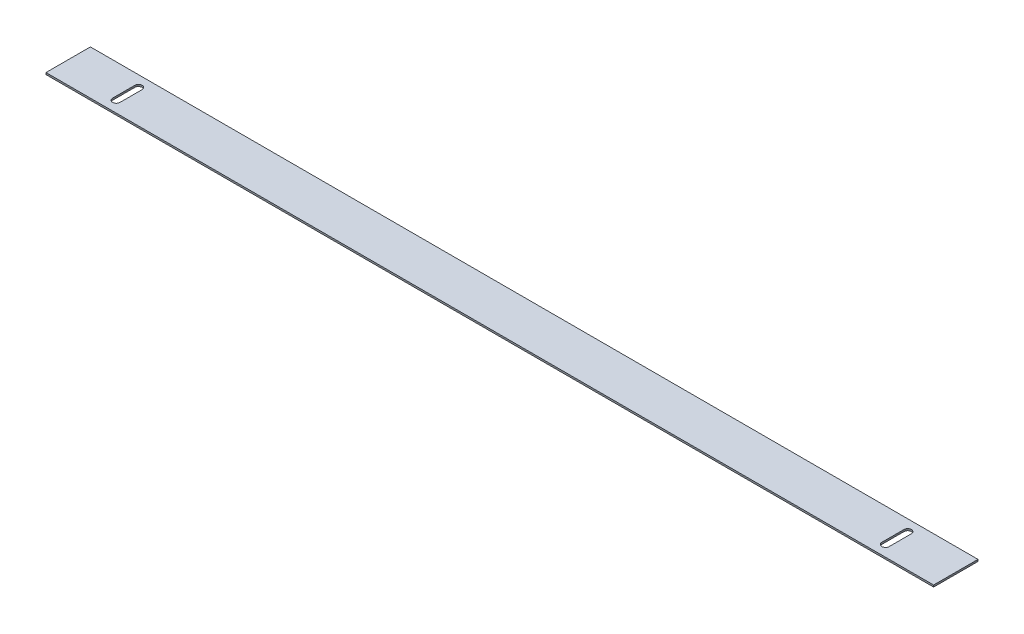
ISO-10303-21;
HEADER;
FILE_DESCRIPTION(('STEP AP214'),'2;1');
FILE_NAME('part.step','',(''),(''),'','','');
FILE_SCHEMA(('AUTOMOTIVE_DESIGN { 1 0 10303 214 1 1 1 1 }'));
ENDSEC;
DATA;
#1=APPLICATION_CONTEXT('core data for automotive mechanical design processes');
#2=APPLICATION_PROTOCOL_DEFINITION('international standard','automotive_design',2000,#1);
#3=PRODUCT_CONTEXT('',#1,'mechanical');
#4=PRODUCT('Part','Part','',(#3));
#5=PRODUCT_RELATED_PRODUCT_CATEGORY('part','',(#4));
#6=PRODUCT_DEFINITION_FORMATION('','',#4);
#7=PRODUCT_DEFINITION_CONTEXT('part definition',#1,'design');
#8=PRODUCT_DEFINITION('design','',#6,#7);
#9=PRODUCT_DEFINITION_SHAPE('','',#8);
#10=(LENGTH_UNIT() NAMED_UNIT(*) SI_UNIT(.MILLI.,.METRE.));
#11=(NAMED_UNIT(*) PLANE_ANGLE_UNIT() SI_UNIT($,.RADIAN.));
#12=(NAMED_UNIT(*) SI_UNIT($,.STERADIAN.) SOLID_ANGLE_UNIT());
#13=UNCERTAINTY_MEASURE_WITH_UNIT(LENGTH_MEASURE(1.E-05),#10,'distance_accuracy_value','');
#14=(GEOMETRIC_REPRESENTATION_CONTEXT(3) GLOBAL_UNCERTAINTY_ASSIGNED_CONTEXT((#13)) GLOBAL_UNIT_ASSIGNED_CONTEXT((#10,
#11,#12)) REPRESENTATION_CONTEXT('',''));
#15=CARTESIAN_POINT('',(0.,0.,0.));
#16=DIRECTION('',(0.,0.,1.));
#17=DIRECTION('',(1.,0.,0.));
#18=AXIS2_PLACEMENT_3D('',#15,#16,#17);
#19=CARTESIAN_POINT('',(0.,0.,0.));
#20=DIRECTION('',(0.,1.,0.));
#21=DIRECTION('',(0.,0.,1.));
#22=AXIS2_PLACEMENT_3D('',#19,#20,#21);
#23=PLANE('',#22);
#24=DIRECTION('',(-1.,0.,0.));
#25=VECTOR('',#24,1.);
#26=CARTESIAN_POINT('',(-381.,0.,-19.05));
#27=LINE('',#26,#25);
#28=CARTESIAN_POINT('',(381.,0.,-19.05));
#29=VERTEX_POINT('',#28);
#30=CARTESIAN_POINT('',(-381.,0.,-19.05));
#31=VERTEX_POINT('',#30);
#32=EDGE_CURVE('E154',#29,#31,#27,.T.);
#33=ORIENTED_EDGE('',*,*,#32,.T.);
#34=DIRECTION('',(0.,0.,1.));
#35=VECTOR('',#34,1.);
#36=CARTESIAN_POINT('',(-381.,0.,-19.05));
#37=LINE('',#36,#35);
#38=CARTESIAN_POINT('',(-381.,0.,19.05));
#39=VERTEX_POINT('',#38);
#40=EDGE_CURVE('E164',#31,#39,#37,.T.);
#41=ORIENTED_EDGE('',*,*,#40,.T.);
#42=DIRECTION('',(1.,0.,0.));
#43=VECTOR('',#42,1.);
#44=CARTESIAN_POINT('',(-381.,0.,19.05));
#45=LINE('',#44,#43);
#46=CARTESIAN_POINT('',(381.,0.,19.05));
#47=VERTEX_POINT('',#46);
#48=EDGE_CURVE('E172',#39,#47,#45,.T.);
#49=ORIENTED_EDGE('',*,*,#48,.T.);
#50=DIRECTION('',(0.,0.,-1.));
#51=VECTOR('',#50,1.);
#52=CARTESIAN_POINT('',(381.,0.,-19.05));
#53=LINE('',#52,#51);
#54=EDGE_CURVE('E177',#47,#29,#53,.T.);
#55=ORIENTED_EDGE('',*,*,#54,.T.);
#56=EDGE_LOOP('',(#33,#41,#49,#55));
#57=FACE_BOUND('',#56,.T.);
#58=CARTESIAN_POINT('',(-330.2,0.,-9.525));
#59=DIRECTION('',(0.,1.,0.));
#60=DIRECTION('',(0.,0.,1.));
#61=AXIS2_PLACEMENT_3D('',#58,#59,#60);
#62=CIRCLE('',#61,3.17499999999998);
#63=CARTESIAN_POINT('',(-327.025,0.,-9.525));
#64=VERTEX_POINT('',#63);
#65=CARTESIAN_POINT('',(-333.375,0.,-9.525));
#66=VERTEX_POINT('',#65);
#67=EDGE_CURVE('E171',#64,#66,#62,.T.);
#68=ORIENTED_EDGE('',*,*,#67,.F.);
#69=DIRECTION('',(0.,0.,-1.));
#70=VECTOR('',#69,1.);
#71=CARTESIAN_POINT('',(-327.025,0.,-9.525));
#72=LINE('',#71,#70);
#73=CARTESIAN_POINT('',(-327.025,0.,9.525));
#74=VERTEX_POINT('',#73);
#75=EDGE_CURVE('E245',#74,#64,#72,.T.);
#76=ORIENTED_EDGE('',*,*,#75,.F.);
#77=CARTESIAN_POINT('',(-330.2,0.,9.525));
#78=DIRECTION('',(0.,1.,0.));
#79=DIRECTION('',(0.,0.,1.));
#80=AXIS2_PLACEMENT_3D('',#77,#78,#79);
#81=CIRCLE('',#80,3.17499999999998);
#82=CARTESIAN_POINT('',(-333.375,0.,9.525));
#83=VERTEX_POINT('',#82);
#84=EDGE_CURVE('E248',#83,#74,#81,.T.);
#85=ORIENTED_EDGE('',*,*,#84,.F.);
#86=DIRECTION('',(0.,0.,1.));
#87=VECTOR('',#86,1.);
#88=CARTESIAN_POINT('',(-333.375,0.,-9.525));
#89=LINE('',#88,#87);
#90=EDGE_CURVE('E252',#66,#83,#89,.T.);
#91=ORIENTED_EDGE('',*,*,#90,.F.);
#92=EDGE_LOOP('',(#68,#76,#85,#91));
#93=FACE_BOUND('',#92,.T.);
#94=CARTESIAN_POINT('',(330.2,0.,-9.525));
#95=DIRECTION('',(0.,1.,0.));
#96=DIRECTION('',(0.,0.,1.));
#97=AXIS2_PLACEMENT_3D('',#94,#95,#96);
#98=CIRCLE('',#97,3.17499999999998);
#99=CARTESIAN_POINT('',(333.375,0.,-9.525));
#100=VERTEX_POINT('',#99);
#101=CARTESIAN_POINT('',(327.025,0.,-9.525));
#102=VERTEX_POINT('',#101);
#103=EDGE_CURVE('E242',#100,#102,#98,.T.);
#104=ORIENTED_EDGE('',*,*,#103,.F.);
#105=DIRECTION('',(0.,0.,-1.));
#106=VECTOR('',#105,1.);
#107=CARTESIAN_POINT('',(333.375,0.,-9.525));
#108=LINE('',#107,#106);
#109=CARTESIAN_POINT('',(333.375,0.,9.525));
#110=VERTEX_POINT('',#109);
#111=EDGE_CURVE('E187',#110,#100,#108,.T.);
#112=ORIENTED_EDGE('',*,*,#111,.F.);
#113=CARTESIAN_POINT('',(330.2,0.,9.525));
#114=DIRECTION('',(0.,1.,0.));
#115=DIRECTION('',(0.,0.,1.));
#116=AXIS2_PLACEMENT_3D('',#113,#114,#115);
#117=CIRCLE('',#116,3.17499999999998);
#118=CARTESIAN_POINT('',(327.025,0.,9.525));
#119=VERTEX_POINT('',#118);
#120=EDGE_CURVE('E236',#119,#110,#117,.T.);
#121=ORIENTED_EDGE('',*,*,#120,.F.);
#122=DIRECTION('',(0.,0.,1.));
#123=VECTOR('',#122,1.);
#124=CARTESIAN_POINT('',(327.025,0.,-9.525));
#125=LINE('',#124,#123);
#126=EDGE_CURVE('E239',#102,#119,#125,.T.);
#127=ORIENTED_EDGE('',*,*,#126,.F.);
#128=EDGE_LOOP('',(#104,#112,#121,#127));
#129=FACE_BOUND('',#128,.T.);
#130=ADVANCED_FACE('F55',(#57,#93,#129),#23,.T.);
#131=CARTESIAN_POINT('',(-381.,0.79375,19.05));
#132=DIRECTION('',(0.,0.,-1.));
#133=DIRECTION('',(-1.,0.,0.));
#134=AXIS2_PLACEMENT_3D('',#131,#132,#133);
#135=PLANE('',#134);
#136=ORIENTED_EDGE('',*,*,#48,.F.);
#137=DIRECTION('',(0.,-1.,0.));
#138=VECTOR('',#137,1.);
#139=CARTESIAN_POINT('',(-381.,0.79375,19.05));
#140=LINE('',#139,#138);
#141=CARTESIAN_POINT('',(-381.,-0.79375,19.05));
#142=VERTEX_POINT('',#141);
#143=EDGE_CURVE('E166',#39,#142,#140,.T.);
#144=ORIENTED_EDGE('',*,*,#143,.T.);
#145=DIRECTION('',(1.,0.,0.));
#146=VECTOR('',#145,1.);
#147=CARTESIAN_POINT('',(-381.,-0.79375,19.05));
#148=LINE('',#147,#146);
#149=CARTESIAN_POINT('',(381.,-0.79375,19.05));
#150=VERTEX_POINT('',#149);
#151=EDGE_CURVE('E269',#142,#150,#148,.T.);
#152=ORIENTED_EDGE('',*,*,#151,.T.);
#153=DIRECTION('',(0.,-1.,0.));
#154=VECTOR('',#153,1.);
#155=CARTESIAN_POINT('',(381.,0.79375,19.05));
#156=LINE('',#155,#154);
#157=EDGE_CURVE('E186',#47,#150,#156,.T.);
#158=ORIENTED_EDGE('',*,*,#157,.F.);
#159=EDGE_LOOP('',(#136,#144,#152,#158));
#160=FACE_BOUND('',#159,.T.);
#161=ADVANCED_FACE('F310',(#160),#135,.F.);
#162=CARTESIAN_POINT('',(-381.,0.79375,-19.05));
#163=DIRECTION('',(1.,0.,0.));
#164=DIRECTION('',(0.,0.,-1.));
#165=AXIS2_PLACEMENT_3D('',#162,#163,#164);
#166=PLANE('',#165);
#167=ORIENTED_EDGE('',*,*,#40,.F.);
#168=DIRECTION('',(0.,-1.,0.));
#169=VECTOR('',#168,1.);
#170=CARTESIAN_POINT('',(-381.,0.79375,-19.05));
#171=LINE('',#170,#169);
#172=CARTESIAN_POINT('',(-381.,-0.79375,-19.05));
#173=VERTEX_POINT('',#172);
#174=EDGE_CURVE('E150',#31,#173,#171,.T.);
#175=ORIENTED_EDGE('',*,*,#174,.T.);
#176=DIRECTION('',(0.,0.,1.));
#177=VECTOR('',#176,1.);
#178=CARTESIAN_POINT('',(-381.,-0.79375,-19.05));
#179=LINE('',#178,#177);
#180=EDGE_CURVE('E196',#173,#142,#179,.T.);
#181=ORIENTED_EDGE('',*,*,#180,.T.);
#182=ORIENTED_EDGE('',*,*,#143,.F.);
#183=EDGE_LOOP('',(#167,#175,#181,#182));
#184=FACE_BOUND('',#183,.T.);
#185=ADVANCED_FACE('F165',(#184),#166,.F.);
#186=CARTESIAN_POINT('',(-333.375,0.79375,-9.525));
#187=DIRECTION('',(1.,0.,0.));
#188=DIRECTION('',(0.,0.,-1.));
#189=AXIS2_PLACEMENT_3D('',#186,#187,#188);
#190=PLANE('',#189);
#191=DIRECTION('',(0.,-1.,0.));
#192=VECTOR('',#191,1.);
#193=CARTESIAN_POINT('',(-333.375,0.79375,-9.525));
#194=LINE('',#193,#192);
#195=CARTESIAN_POINT('',(-333.375,-0.79375,-9.525));
#196=VERTEX_POINT('',#195);
#197=EDGE_CURVE('E192',#66,#196,#194,.T.);
#198=ORIENTED_EDGE('',*,*,#197,.F.);
#199=ORIENTED_EDGE('',*,*,#90,.T.);
#200=DIRECTION('',(0.,-1.,0.));
#201=VECTOR('',#200,1.);
#202=CARTESIAN_POINT('',(-333.375,0.79375,9.525));
#203=LINE('',#202,#201);
#204=CARTESIAN_POINT('',(-333.375,-0.79375,9.525));
#205=VERTEX_POINT('',#204);
#206=EDGE_CURVE('E195',#83,#205,#203,.T.);
#207=ORIENTED_EDGE('',*,*,#206,.T.);
#208=DIRECTION('',(0.,0.,1.));
#209=VECTOR('',#208,1.);
#210=CARTESIAN_POINT('',(-333.375,-0.79375,-9.525));
#211=LINE('',#210,#209);
#212=EDGE_CURVE('E285',#196,#205,#211,.T.);
#213=ORIENTED_EDGE('',*,*,#212,.F.);
#214=EDGE_LOOP('',(#198,#199,#207,#213));
#215=FACE_BOUND('',#214,.T.);
#216=ADVANCED_FACE('F300',(#215),#190,.T.);
#217=CARTESIAN_POINT('',(327.025,0.79375,-9.525));
#218=DIRECTION('',(1.,0.,0.));
#219=DIRECTION('',(0.,0.,-1.));
#220=AXIS2_PLACEMENT_3D('',#217,#218,#219);
#221=PLANE('',#220);
#222=DIRECTION('',(0.,-1.,0.));
#223=VECTOR('',#222,1.);
#224=CARTESIAN_POINT('',(327.025,0.79375,-9.525));
#225=LINE('',#224,#223);
#226=CARTESIAN_POINT('',(327.025,-0.79375,-9.525));
#227=VERTEX_POINT('',#226);
#228=EDGE_CURVE('E73',#102,#227,#225,.T.);
#229=ORIENTED_EDGE('',*,*,#228,.F.);
#230=ORIENTED_EDGE('',*,*,#126,.T.);
#231=DIRECTION('',(0.,-1.,0.));
#232=VECTOR('',#231,1.);
#233=CARTESIAN_POINT('',(327.025,0.79375,9.525));
#234=LINE('',#233,#232);
#235=CARTESIAN_POINT('',(327.025,-0.79375,9.525));
#236=VERTEX_POINT('',#235);
#237=EDGE_CURVE('E80',#119,#236,#234,.T.);
#238=ORIENTED_EDGE('',*,*,#237,.T.);
#239=DIRECTION('',(0.,0.,1.));
#240=VECTOR('',#239,1.);
#241=CARTESIAN_POINT('',(327.025,-0.79375,-9.525));
#242=LINE('',#241,#240);
#243=EDGE_CURVE('E65',#227,#236,#242,.T.);
#244=ORIENTED_EDGE('',*,*,#243,.F.);
#245=EDGE_LOOP('',(#229,#230,#238,#244));
#246=FACE_BOUND('',#245,.T.);
#247=ADVANCED_FACE('F314',(#246),#221,.T.);
#248=CARTESIAN_POINT('',(0.,-0.79375,0.));
#249=DIRECTION('',(0.,1.,0.));
#250=DIRECTION('',(0.,0.,1.));
#251=AXIS2_PLACEMENT_3D('',#248,#249,#250);
#252=PLANE('',#251);
#253=CARTESIAN_POINT('',(-330.2,-0.79375,-9.525));
#254=DIRECTION('',(0.,1.,0.));
#255=DIRECTION('',(0.,0.,1.));
#256=AXIS2_PLACEMENT_3D('',#253,#254,#255);
#257=CIRCLE('',#256,3.17499999999998);
#258=CARTESIAN_POINT('',(-327.025,-0.79375,-9.525));
#259=VERTEX_POINT('',#258);
#260=EDGE_CURVE('E208',#259,#196,#257,.T.);
#261=ORIENTED_EDGE('',*,*,#260,.T.);
#262=ORIENTED_EDGE('',*,*,#212,.T.);
#263=CARTESIAN_POINT('',(-330.2,-0.79375,9.525));
#264=DIRECTION('',(0.,1.,0.));
#265=DIRECTION('',(0.,0.,1.));
#266=AXIS2_PLACEMENT_3D('',#263,#264,#265);
#267=CIRCLE('',#266,3.17499999999998);
#268=CARTESIAN_POINT('',(-327.025,-0.79375,9.525));
#269=VERTEX_POINT('',#268);
#270=EDGE_CURVE('E282',#205,#269,#267,.T.);
#271=ORIENTED_EDGE('',*,*,#270,.T.);
#272=DIRECTION('',(0.,0.,-1.));
#273=VECTOR('',#272,1.);
#274=CARTESIAN_POINT('',(-327.025,-0.79375,-9.525));
#275=LINE('',#274,#273);
#276=EDGE_CURVE('E205',#269,#259,#275,.T.);
#277=ORIENTED_EDGE('',*,*,#276,.T.);
#278=EDGE_LOOP('',(#261,#262,#271,#277));
#279=FACE_BOUND('',#278,.T.);
#280=ORIENTED_EDGE('',*,*,#180,.F.);
#281=DIRECTION('',(-1.,0.,0.));
#282=VECTOR('',#281,1.);
#283=CARTESIAN_POINT('',(-381.,-0.79375,-19.05));
#284=LINE('',#283,#282);
#285=CARTESIAN_POINT('',(381.,-0.79375,-19.05));
#286=VERTEX_POINT('',#285);
#287=EDGE_CURVE('E156',#286,#173,#284,.T.);
#288=ORIENTED_EDGE('',*,*,#287,.F.);
#289=DIRECTION('',(0.,0.,-1.));
#290=VECTOR('',#289,1.);
#291=CARTESIAN_POINT('',(381.,-0.79375,-19.05));
#292=LINE('',#291,#290);
#293=EDGE_CURVE('E265',#150,#286,#292,.T.);
#294=ORIENTED_EDGE('',*,*,#293,.F.);
#295=ORIENTED_EDGE('',*,*,#151,.F.);
#296=EDGE_LOOP('',(#280,#288,#294,#295));
#297=FACE_BOUND('',#296,.T.);
#298=CARTESIAN_POINT('',(330.2,-0.79375,-9.525));
#299=DIRECTION('',(0.,1.,0.));
#300=DIRECTION('',(0.,0.,-1.));
#301=AXIS2_PLACEMENT_3D('',#298,#299,#300);
#302=CIRCLE('',#301,3.17499999999998);
#303=CARTESIAN_POINT('',(333.375,-0.79375,-9.525));
#304=VERTEX_POINT('',#303);
#305=EDGE_CURVE('E12',#304,#227,#302,.T.);
#306=ORIENTED_EDGE('',*,*,#305,.T.);
#307=ORIENTED_EDGE('',*,*,#243,.T.);
#308=CARTESIAN_POINT('',(330.2,-0.79375,9.525));
#309=DIRECTION('',(0.,1.,0.));
#310=DIRECTION('',(0.,0.,-1.));
#311=AXIS2_PLACEMENT_3D('',#308,#309,#310);
#312=CIRCLE('',#311,3.17499999999998);
#313=CARTESIAN_POINT('',(333.375,-0.79375,9.525));
#314=VERTEX_POINT('',#313);
#315=EDGE_CURVE('E222',#236,#314,#312,.T.);
#316=ORIENTED_EDGE('',*,*,#315,.T.);
#317=DIRECTION('',(0.,0.,-1.));
#318=VECTOR('',#317,1.);
#319=CARTESIAN_POINT('',(333.375,-0.79375,-9.525));
#320=LINE('',#319,#318);
#321=EDGE_CURVE('E217',#314,#304,#320,.T.);
#322=ORIENTED_EDGE('',*,*,#321,.T.);
#323=EDGE_LOOP('',(#306,#307,#316,#322));
#324=FACE_BOUND('',#323,.T.);
#325=ADVANCED_FACE('F271',(#279,#297,#324),#252,.F.);
#326=CARTESIAN_POINT('',(330.2,0.79375,-9.525));
#327=DIRECTION('',(0.,-1.,0.));
#328=DIRECTION('',(0.,0.,-1.));
#329=AXIS2_PLACEMENT_3D('',#326,#327,#328);
#330=CYLINDRICAL_SURFACE('',#329,3.17499999999998);
#331=DIRECTION('',(0.,-1.,0.));
#332=VECTOR('',#331,1.);
#333=CARTESIAN_POINT('',(333.375,0.79375,-9.525));
#334=LINE('',#333,#332);
#335=EDGE_CURVE('E59',#100,#304,#334,.T.);
#336=ORIENTED_EDGE('',*,*,#335,.F.);
#337=ORIENTED_EDGE('',*,*,#103,.T.);
#338=ORIENTED_EDGE('',*,*,#228,.T.);
#339=ORIENTED_EDGE('',*,*,#305,.F.);
#340=EDGE_LOOP('',(#336,#337,#338,#339));
#341=FACE_BOUND('',#340,.T.);
#342=ADVANCED_FACE('F313',(#341),#330,.F.);
#343=CARTESIAN_POINT('',(330.2,0.79375,9.525));
#344=DIRECTION('',(0.,-1.,0.));
#345=DIRECTION('',(0.,0.,-1.));
#346=AXIS2_PLACEMENT_3D('',#343,#344,#345);
#347=CYLINDRICAL_SURFACE('',#346,3.17499999999998);
#348=ORIENTED_EDGE('',*,*,#237,.F.);
#349=ORIENTED_EDGE('',*,*,#120,.T.);
#350=DIRECTION('',(0.,-1.,0.));
#351=VECTOR('',#350,1.);
#352=CARTESIAN_POINT('',(333.375,0.79375,9.525));
#353=LINE('',#352,#351);
#354=EDGE_CURVE('E210',#110,#314,#353,.T.);
#355=ORIENTED_EDGE('',*,*,#354,.T.);
#356=ORIENTED_EDGE('',*,*,#315,.F.);
#357=EDGE_LOOP('',(#348,#349,#355,#356));
#358=FACE_BOUND('',#357,.T.);
#359=ADVANCED_FACE('F315',(#358),#347,.F.);
#360=CARTESIAN_POINT('',(333.375,0.79375,-9.525));
#361=DIRECTION('',(-1.,0.,0.));
#362=DIRECTION('',(0.,0.,1.));
#363=AXIS2_PLACEMENT_3D('',#360,#361,#362);
#364=PLANE('',#363);
#365=ORIENTED_EDGE('',*,*,#354,.F.);
#366=ORIENTED_EDGE('',*,*,#111,.T.);
#367=ORIENTED_EDGE('',*,*,#335,.T.);
#368=ORIENTED_EDGE('',*,*,#321,.F.);
#369=EDGE_LOOP('',(#365,#366,#367,#368));
#370=FACE_BOUND('',#369,.T.);
#371=ADVANCED_FACE('F57',(#370),#364,.T.);
#372=CARTESIAN_POINT('',(-330.2,0.79375,-9.525));
#373=DIRECTION('',(0.,-1.,0.));
#374=DIRECTION('',(0.,0.,-1.));
#375=AXIS2_PLACEMENT_3D('',#372,#373,#374);
#376=CYLINDRICAL_SURFACE('',#375,3.17499999999998);
#377=DIRECTION('',(0.,-1.,0.));
#378=VECTOR('',#377,1.);
#379=CARTESIAN_POINT('',(-327.025,0.79375,-9.525));
#380=LINE('',#379,#378);
#381=EDGE_CURVE('E202',#64,#259,#380,.T.);
#382=ORIENTED_EDGE('',*,*,#381,.F.);
#383=ORIENTED_EDGE('',*,*,#67,.T.);
#384=ORIENTED_EDGE('',*,*,#197,.T.);
#385=ORIENTED_EDGE('',*,*,#260,.F.);
#386=EDGE_LOOP('',(#382,#383,#384,#385));
#387=FACE_BOUND('',#386,.T.);
#388=ADVANCED_FACE('F296',(#387),#376,.F.);
#389=CARTESIAN_POINT('',(-330.2,0.79375,9.525));
#390=DIRECTION('',(0.,-1.,0.));
#391=DIRECTION('',(0.,0.,-1.));
#392=AXIS2_PLACEMENT_3D('',#389,#390,#391);
#393=CYLINDRICAL_SURFACE('',#392,3.17499999999998);
#394=ORIENTED_EDGE('',*,*,#206,.F.);
#395=ORIENTED_EDGE('',*,*,#84,.T.);
#396=DIRECTION('',(0.,-1.,0.));
#397=VECTOR('',#396,1.);
#398=CARTESIAN_POINT('',(-327.025,0.79375,9.525));
#399=LINE('',#398,#397);
#400=EDGE_CURVE('E199',#74,#269,#399,.T.);
#401=ORIENTED_EDGE('',*,*,#400,.T.);
#402=ORIENTED_EDGE('',*,*,#270,.F.);
#403=EDGE_LOOP('',(#394,#395,#401,#402));
#404=FACE_BOUND('',#403,.T.);
#405=ADVANCED_FACE('F304',(#404),#393,.F.);
#406=CARTESIAN_POINT('',(-327.025,0.79375,-9.525));
#407=DIRECTION('',(-1.,0.,0.));
#408=DIRECTION('',(0.,0.,1.));
#409=AXIS2_PLACEMENT_3D('',#406,#407,#408);
#410=PLANE('',#409);
#411=ORIENTED_EDGE('',*,*,#400,.F.);
#412=ORIENTED_EDGE('',*,*,#75,.T.);
#413=ORIENTED_EDGE('',*,*,#381,.T.);
#414=ORIENTED_EDGE('',*,*,#276,.F.);
#415=EDGE_LOOP('',(#411,#412,#413,#414));
#416=FACE_BOUND('',#415,.T.);
#417=ADVANCED_FACE('F307',(#416),#410,.T.);
#418=CARTESIAN_POINT('',(381.,0.79375,-19.05));
#419=DIRECTION('',(-1.,0.,0.));
#420=DIRECTION('',(0.,0.,1.));
#421=AXIS2_PLACEMENT_3D('',#418,#419,#420);
#422=PLANE('',#421);
#423=ORIENTED_EDGE('',*,*,#54,.F.);
#424=ORIENTED_EDGE('',*,*,#157,.T.);
#425=ORIENTED_EDGE('',*,*,#293,.T.);
#426=DIRECTION('',(0.,-1.,0.));
#427=VECTOR('',#426,1.);
#428=CARTESIAN_POINT('',(381.,0.79375,-19.05));
#429=LINE('',#428,#427);
#430=EDGE_CURVE('E161',#29,#286,#429,.T.);
#431=ORIENTED_EDGE('',*,*,#430,.F.);
#432=EDGE_LOOP('',(#423,#424,#425,#431));
#433=FACE_BOUND('',#432,.T.);
#434=ADVANCED_FACE('F261',(#433),#422,.F.);
#435=CARTESIAN_POINT('',(-381.,0.79375,-19.05));
#436=DIRECTION('',(0.,0.,1.));
#437=DIRECTION('',(1.,0.,0.));
#438=AXIS2_PLACEMENT_3D('',#435,#436,#437);
#439=PLANE('',#438);
#440=ORIENTED_EDGE('',*,*,#32,.F.);
#441=ORIENTED_EDGE('',*,*,#430,.T.);
#442=ORIENTED_EDGE('',*,*,#287,.T.);
#443=ORIENTED_EDGE('',*,*,#174,.F.);
#444=EDGE_LOOP('',(#440,#441,#442,#443));
#445=FACE_BOUND('',#444,.T.);
#446=ADVANCED_FACE('F152',(#445),#439,.F.);
#447=CLOSED_SHELL('',(#130,#161,#185,#216,#247,#325,#342,#359,#371,#388,#405,#417,#434,#446));
#448=MANIFOLD_SOLID_BREP('B2',#447);
#449=CARTESIAN_POINT('',(0.,0.,0.));
#450=DIRECTION('',(0.,1.,0.));
#451=DIRECTION('',(0.,0.,1.));
#452=AXIS2_PLACEMENT_3D('',#449,#450,#451);
#453=PLANE('',#452);
#454=CARTESIAN_POINT('',(330.2,0.,-9.525));
#455=DIRECTION('',(0.,1.,0.));
#456=DIRECTION('',(0.,0.,1.));
#457=AXIS2_PLACEMENT_3D('',#454,#455,#456);
#458=CIRCLE('',#457,3.17499999999998);
#459=CARTESIAN_POINT('',(333.375,0.,-9.525));
#460=VERTEX_POINT('',#459);
#461=CARTESIAN_POINT('',(327.025,0.,-9.525));
#462=VERTEX_POINT('',#461);
#463=EDGE_CURVE('E617',#460,#462,#458,.T.);
#464=ORIENTED_EDGE('',*,*,#463,.T.);
#465=DIRECTION('',(0.,0.,1.));
#466=VECTOR('',#465,1.);
#467=CARTESIAN_POINT('',(327.025,0.,-9.525));
#468=LINE('',#467,#466);
#469=CARTESIAN_POINT('',(327.025,0.,9.525));
#470=VERTEX_POINT('',#469);
#471=EDGE_CURVE('E555',#462,#470,#468,.T.);
#472=ORIENTED_EDGE('',*,*,#471,.T.);
#473=CARTESIAN_POINT('',(330.2,0.,9.525));
#474=DIRECTION('',(0.,1.,0.));
#475=DIRECTION('',(0.,0.,1.));
#476=AXIS2_PLACEMENT_3D('',#473,#474,#475);
#477=CIRCLE('',#476,3.17499999999998);
#478=CARTESIAN_POINT('',(333.375,0.,9.525));
#479=VERTEX_POINT('',#478);
#480=EDGE_CURVE('E460',#470,#479,#477,.T.);
#481=ORIENTED_EDGE('',*,*,#480,.T.);
#482=DIRECTION('',(0.,0.,-1.));
#483=VECTOR('',#482,1.);
#484=CARTESIAN_POINT('',(333.375,0.,-9.525));
#485=LINE('',#484,#483);
#486=EDGE_CURVE('E53',#479,#460,#485,.T.);
#487=ORIENTED_EDGE('',*,*,#486,.T.);
#488=EDGE_LOOP('',(#464,#472,#481,#487));
#489=FACE_BOUND('',#488,.T.);
#490=CARTESIAN_POINT('',(-330.2,0.,-9.525));
#491=DIRECTION('',(0.,1.,0.));
#492=DIRECTION('',(0.,0.,1.));
#493=AXIS2_PLACEMENT_3D('',#490,#491,#492);
#494=CIRCLE('',#493,3.17499999999998);
#495=CARTESIAN_POINT('',(-327.025,0.,-9.525));
#496=VERTEX_POINT('',#495);
#497=CARTESIAN_POINT('',(-333.375,0.,-9.525));
#498=VERTEX_POINT('',#497);
#499=EDGE_CURVE('E627',#496,#498,#494,.T.);
#500=ORIENTED_EDGE('',*,*,#499,.T.);
#501=DIRECTION('',(0.,0.,1.));
#502=VECTOR('',#501,1.);
#503=CARTESIAN_POINT('',(-333.375,0.,-9.525));
#504=LINE('',#503,#502);
#505=CARTESIAN_POINT('',(-333.375,0.,9.525));
#506=VERTEX_POINT('',#505);
#507=EDGE_CURVE('E624',#498,#506,#504,.T.);
#508=ORIENTED_EDGE('',*,*,#507,.T.);
#509=CARTESIAN_POINT('',(-330.2,0.,9.525));
#510=DIRECTION('',(0.,1.,0.));
#511=DIRECTION('',(0.,0.,1.));
#512=AXIS2_PLACEMENT_3D('',#509,#510,#511);
#513=CIRCLE('',#512,3.17499999999998);
#514=CARTESIAN_POINT('',(-327.025,0.,9.525));
#515=VERTEX_POINT('',#514);
#516=EDGE_CURVE('E621',#506,#515,#513,.T.);
#517=ORIENTED_EDGE('',*,*,#516,.T.);
#518=DIRECTION('',(0.,0.,-1.));
#519=VECTOR('',#518,1.);
#520=CARTESIAN_POINT('',(-327.025,0.,-9.525));
#521=LINE('',#520,#519);
#522=EDGE_CURVE('E619',#515,#496,#521,.T.);
#523=ORIENTED_EDGE('',*,*,#522,.T.);
#524=EDGE_LOOP('',(#500,#508,#517,#523));
#525=FACE_BOUND('',#524,.T.);
#526=DIRECTION('',(-1.,0.,0.));
#527=VECTOR('',#526,1.);
#528=CARTESIAN_POINT('',(-381.,0.,-19.05));
#529=LINE('',#528,#527);
#530=CARTESIAN_POINT('',(381.,0.,-19.05));
#531=VERTEX_POINT('',#530);
#532=CARTESIAN_POINT('',(-381.,0.,-19.05));
#533=VERTEX_POINT('',#532);
#534=EDGE_CURVE('E613',#531,#533,#529,.T.);
#535=ORIENTED_EDGE('',*,*,#534,.F.);
#536=DIRECTION('',(0.,0.,-1.));
#537=VECTOR('',#536,1.);
#538=CARTESIAN_POINT('',(381.,0.,-19.05));
#539=LINE('',#538,#537);
#540=CARTESIAN_POINT('',(381.,0.,19.05));
#541=VERTEX_POINT('',#540);
#542=EDGE_CURVE('E632',#541,#531,#539,.T.);
#543=ORIENTED_EDGE('',*,*,#542,.F.);
#544=DIRECTION('',(1.,0.,0.));
#545=VECTOR('',#544,1.);
#546=CARTESIAN_POINT('',(-381.,0.,19.05));
#547=LINE('',#546,#545);
#548=CARTESIAN_POINT('',(-381.,0.,19.05));
#549=VERTEX_POINT('',#548);
#550=EDGE_CURVE('E633',#549,#541,#547,.T.);
#551=ORIENTED_EDGE('',*,*,#550,.F.);
#552=DIRECTION('',(0.,0.,1.));
#553=VECTOR('',#552,1.);
#554=CARTESIAN_POINT('',(-381.,0.,-19.05));
#555=LINE('',#554,#553);
#556=EDGE_CURVE('E455',#533,#549,#555,.T.);
#557=ORIENTED_EDGE('',*,*,#556,.F.);
#558=EDGE_LOOP('',(#535,#543,#551,#557));
#559=FACE_BOUND('',#558,.T.);
#560=ADVANCED_FACE('F452',(#489,#525,#559),#453,.F.);
#561=CARTESIAN_POINT('',(0.,0.79375,0.));
#562=DIRECTION('',(0.,1.,0.));
#563=DIRECTION('',(0.,0.,1.));
#564=AXIS2_PLACEMENT_3D('',#561,#562,#563);
#565=PLANE('',#564);
#566=DIRECTION('',(0.,0.,1.));
#567=VECTOR('',#566,1.);
#568=CARTESIAN_POINT('',(-381.,0.79375,-19.05));
#569=LINE('',#568,#567);
#570=CARTESIAN_POINT('',(-381.,0.79375,-19.05));
#571=VERTEX_POINT('',#570);
#572=CARTESIAN_POINT('',(-381.,0.79375,19.05));
#573=VERTEX_POINT('',#572);
#574=EDGE_CURVE('E593',#571,#573,#569,.T.);
#575=ORIENTED_EDGE('',*,*,#574,.T.);
#576=DIRECTION('',(1.,0.,0.));
#577=VECTOR('',#576,1.);
#578=CARTESIAN_POINT('',(-381.,0.79375,19.05));
#579=LINE('',#578,#577);
#580=CARTESIAN_POINT('',(381.,0.79375,19.05));
#581=VERTEX_POINT('',#580);
#582=EDGE_CURVE('E596',#573,#581,#579,.T.);
#583=ORIENTED_EDGE('',*,*,#582,.T.);
#584=DIRECTION('',(0.,0.,-1.));
#585=VECTOR('',#584,1.);
#586=CARTESIAN_POINT('',(381.,0.79375,-19.05));
#587=LINE('',#586,#585);
#588=CARTESIAN_POINT('',(381.,0.79375,-19.05));
#589=VERTEX_POINT('',#588);
#590=EDGE_CURVE('E598',#581,#589,#587,.T.);
#591=ORIENTED_EDGE('',*,*,#590,.T.);
#592=DIRECTION('',(-1.,0.,0.));
#593=VECTOR('',#592,1.);
#594=CARTESIAN_POINT('',(-381.,0.79375,-19.05));
#595=LINE('',#594,#593);
#596=EDGE_CURVE('E600',#589,#571,#595,.T.);
#597=ORIENTED_EDGE('',*,*,#596,.T.);
#598=EDGE_LOOP('',(#575,#583,#591,#597));
#599=FACE_BOUND('',#598,.T.);
#600=DIRECTION('',(0.,0.,1.));
#601=VECTOR('',#600,1.);
#602=CARTESIAN_POINT('',(-333.375,0.79375,-9.525));
#603=LINE('',#602,#601);
#604=CARTESIAN_POINT('',(-333.375,0.79375,-9.525));
#605=VERTEX_POINT('',#604);
#606=CARTESIAN_POINT('',(-333.375,0.79375,9.525));
#607=VERTEX_POINT('',#606);
#608=EDGE_CURVE('E574',#605,#607,#603,.T.);
#609=ORIENTED_EDGE('',*,*,#608,.F.);
#610=CARTESIAN_POINT('',(-330.2,0.79375,-9.525));
#611=DIRECTION('',(0.,1.,0.));
#612=DIRECTION('',(0.,0.,1.));
#613=AXIS2_PLACEMENT_3D('',#610,#611,#612);
#614=CIRCLE('',#613,3.17499999999998);
#615=CARTESIAN_POINT('',(-327.025,0.79375,-9.525));
#616=VERTEX_POINT('',#615);
#617=EDGE_CURVE('E556',#616,#605,#614,.T.);
#618=ORIENTED_EDGE('',*,*,#617,.F.);
#619=DIRECTION('',(0.,0.,-1.));
#620=VECTOR('',#619,1.);
#621=CARTESIAN_POINT('',(-327.025,0.79375,-9.525));
#622=LINE('',#621,#620);
#623=CARTESIAN_POINT('',(-327.025,0.79375,9.525));
#624=VERTEX_POINT('',#623);
#625=EDGE_CURVE('E579',#624,#616,#622,.T.);
#626=ORIENTED_EDGE('',*,*,#625,.F.);
#627=CARTESIAN_POINT('',(-330.2,0.79375,9.525));
#628=DIRECTION('',(0.,1.,0.));
#629=DIRECTION('',(0.,0.,1.));
#630=AXIS2_PLACEMENT_3D('',#627,#628,#629);
#631=CIRCLE('',#630,3.17499999999998);
#632=EDGE_CURVE('E576',#607,#624,#631,.T.);
#633=ORIENTED_EDGE('',*,*,#632,.F.);
#634=EDGE_LOOP('',(#609,#618,#626,#633));
#635=FACE_BOUND('',#634,.T.);
#636=DIRECTION('',(0.,0.,1.));
#637=VECTOR('',#636,1.);
#638=CARTESIAN_POINT('',(327.025,0.79375,-9.525));
#639=LINE('',#638,#637);
#640=CARTESIAN_POINT('',(327.025,0.79375,-9.525));
#641=VERTEX_POINT('',#640);
#642=CARTESIAN_POINT('',(327.025,0.79375,9.525));
#643=VERTEX_POINT('',#642);
#644=EDGE_CURVE('E548',#641,#643,#639,.T.);
#645=ORIENTED_EDGE('',*,*,#644,.F.);
#646=CARTESIAN_POINT('',(330.2,0.79375,-9.525));
#647=DIRECTION('',(0.,1.,0.));
#648=DIRECTION('',(0.,0.,-1.));
#649=AXIS2_PLACEMENT_3D('',#646,#647,#648);
#650=CIRCLE('',#649,3.17499999999998);
#651=CARTESIAN_POINT('',(333.375,0.79375,-9.525));
#652=VERTEX_POINT('',#651);
#653=EDGE_CURVE('E540',#652,#641,#650,.T.);
#654=ORIENTED_EDGE('',*,*,#653,.F.);
#655=DIRECTION('',(0.,0.,-1.));
#656=VECTOR('',#655,1.);
#657=CARTESIAN_POINT('',(333.375,0.79375,-9.525));
#658=LINE('',#657,#656);
#659=CARTESIAN_POINT('',(333.375,0.79375,9.525));
#660=VERTEX_POINT('',#659);
#661=EDGE_CURVE('E564',#660,#652,#658,.T.);
#662=ORIENTED_EDGE('',*,*,#661,.F.);
#663=CARTESIAN_POINT('',(330.2,0.79375,9.525));
#664=DIRECTION('',(0.,1.,0.));
#665=DIRECTION('',(0.,0.,-1.));
#666=AXIS2_PLACEMENT_3D('',#663,#664,#665);
#667=CIRCLE('',#666,3.17499999999998);
#668=EDGE_CURVE('E562',#643,#660,#667,.T.);
#669=ORIENTED_EDGE('',*,*,#668,.F.);
#670=EDGE_LOOP('',(#645,#654,#662,#669));
#671=FACE_BOUND('',#670,.T.);
#672=ADVANCED_FACE('F560',(#599,#635,#671),#565,.T.);
#673=CARTESIAN_POINT('',(-381.,0.79375,-19.05));
#674=DIRECTION('',(1.,0.,0.));
#675=DIRECTION('',(0.,0.,-1.));
#676=AXIS2_PLACEMENT_3D('',#673,#674,#675);
#677=PLANE('',#676);
#678=DIRECTION('',(0.,-1.,0.));
#679=VECTOR('',#678,1.);
#680=CARTESIAN_POINT('',(-381.,0.79375,-19.05));
#681=LINE('',#680,#679);
#682=EDGE_CURVE('E602',#571,#533,#681,.T.);
#683=ORIENTED_EDGE('',*,*,#682,.T.);
#684=ORIENTED_EDGE('',*,*,#556,.T.);
#685=DIRECTION('',(0.,-1.,0.));
#686=VECTOR('',#685,1.);
#687=CARTESIAN_POINT('',(-381.,0.79375,19.05));
#688=LINE('',#687,#686);
#689=EDGE_CURVE('E611',#573,#549,#688,.T.);
#690=ORIENTED_EDGE('',*,*,#689,.F.);
#691=ORIENTED_EDGE('',*,*,#574,.F.);
#692=EDGE_LOOP('',(#683,#684,#690,#691));
#693=FACE_BOUND('',#692,.T.);
#694=ADVANCED_FACE('F640',(#693),#677,.F.);
#695=CARTESIAN_POINT('',(-381.,0.79375,19.05));
#696=DIRECTION('',(0.,0.,-1.));
#697=DIRECTION('',(-1.,0.,0.));
#698=AXIS2_PLACEMENT_3D('',#695,#696,#697);
#699=PLANE('',#698);
#700=ORIENTED_EDGE('',*,*,#689,.T.);
#701=ORIENTED_EDGE('',*,*,#550,.T.);
#702=DIRECTION('',(0.,-1.,0.));
#703=VECTOR('',#702,1.);
#704=CARTESIAN_POINT('',(381.,0.79375,19.05));
#705=LINE('',#704,#703);
#706=EDGE_CURVE('E608',#581,#541,#705,.T.);
#707=ORIENTED_EDGE('',*,*,#706,.F.);
#708=ORIENTED_EDGE('',*,*,#582,.F.);
#709=EDGE_LOOP('',(#700,#701,#707,#708));
#710=FACE_BOUND('',#709,.T.);
#711=ADVANCED_FACE('F645',(#710),#699,.F.);
#712=CARTESIAN_POINT('',(381.,0.79375,-19.05));
#713=DIRECTION('',(-1.,0.,0.));
#714=DIRECTION('',(0.,0.,1.));
#715=AXIS2_PLACEMENT_3D('',#712,#713,#714);
#716=PLANE('',#715);
#717=ORIENTED_EDGE('',*,*,#706,.T.);
#718=ORIENTED_EDGE('',*,*,#542,.T.);
#719=DIRECTION('',(0.,-1.,0.));
#720=VECTOR('',#719,1.);
#721=CARTESIAN_POINT('',(381.,0.79375,-19.05));
#722=LINE('',#721,#720);
#723=EDGE_CURVE('E605',#589,#531,#722,.T.);
#724=ORIENTED_EDGE('',*,*,#723,.F.);
#725=ORIENTED_EDGE('',*,*,#590,.F.);
#726=EDGE_LOOP('',(#717,#718,#724,#725));
#727=FACE_BOUND('',#726,.T.);
#728=ADVANCED_FACE('F654',(#727),#716,.F.);
#729=CARTESIAN_POINT('',(-381.,0.79375,-19.05));
#730=DIRECTION('',(0.,0.,1.));
#731=DIRECTION('',(1.,0.,0.));
#732=AXIS2_PLACEMENT_3D('',#729,#730,#731);
#733=PLANE('',#732);
#734=ORIENTED_EDGE('',*,*,#723,.T.);
#735=ORIENTED_EDGE('',*,*,#534,.T.);
#736=ORIENTED_EDGE('',*,*,#682,.F.);
#737=ORIENTED_EDGE('',*,*,#596,.F.);
#738=EDGE_LOOP('',(#734,#735,#736,#737));
#739=FACE_BOUND('',#738,.T.);
#740=ADVANCED_FACE('F652',(#739),#733,.F.);
#741=CARTESIAN_POINT('',(-330.2,0.79375,-9.525));
#742=DIRECTION('',(0.,-1.,0.));
#743=DIRECTION('',(0.,0.,-1.));
#744=AXIS2_PLACEMENT_3D('',#741,#742,#743);
#745=CYLINDRICAL_SURFACE('',#744,3.17499999999998);
#746=ORIENTED_EDGE('',*,*,#499,.F.);
#747=DIRECTION('',(0.,-1.,0.));
#748=VECTOR('',#747,1.);
#749=CARTESIAN_POINT('',(-327.025,0.79375,-9.525));
#750=LINE('',#749,#748);
#751=EDGE_CURVE('E581',#616,#496,#750,.T.);
#752=ORIENTED_EDGE('',*,*,#751,.F.);
#753=ORIENTED_EDGE('',*,*,#617,.T.);
#754=DIRECTION('',(0.,-1.,0.));
#755=VECTOR('',#754,1.);
#756=CARTESIAN_POINT('',(-333.375,0.79375,-9.525));
#757=LINE('',#756,#755);
#758=EDGE_CURVE('E590',#605,#498,#757,.T.);
#759=ORIENTED_EDGE('',*,*,#758,.T.);
#760=EDGE_LOOP('',(#746,#752,#753,#759));
#761=FACE_BOUND('',#760,.T.);
#762=ADVANCED_FACE('F661',(#761),#745,.F.);
#763=CARTESIAN_POINT('',(-333.375,0.79375,-9.525));
#764=DIRECTION('',(1.,0.,0.));
#765=DIRECTION('',(0.,0.,-1.));
#766=AXIS2_PLACEMENT_3D('',#763,#764,#765);
#767=PLANE('',#766);
#768=ORIENTED_EDGE('',*,*,#507,.F.);
#769=ORIENTED_EDGE('',*,*,#758,.F.);
#770=ORIENTED_EDGE('',*,*,#608,.T.);
#771=DIRECTION('',(0.,-1.,0.));
#772=VECTOR('',#771,1.);
#773=CARTESIAN_POINT('',(-333.375,0.79375,9.525));
#774=LINE('',#773,#772);
#775=EDGE_CURVE('E587',#607,#506,#774,.T.);
#776=ORIENTED_EDGE('',*,*,#775,.T.);
#777=EDGE_LOOP('',(#768,#769,#770,#776));
#778=FACE_BOUND('',#777,.T.);
#779=ADVANCED_FACE('F691',(#778),#767,.T.);
#780=CARTESIAN_POINT('',(-330.2,0.79375,9.525));
#781=DIRECTION('',(0.,-1.,0.));
#782=DIRECTION('',(0.,0.,-1.));
#783=AXIS2_PLACEMENT_3D('',#780,#781,#782);
#784=CYLINDRICAL_SURFACE('',#783,3.17499999999998);
#785=ORIENTED_EDGE('',*,*,#516,.F.);
#786=ORIENTED_EDGE('',*,*,#775,.F.);
#787=ORIENTED_EDGE('',*,*,#632,.T.);
#788=DIRECTION('',(0.,-1.,0.));
#789=VECTOR('',#788,1.);
#790=CARTESIAN_POINT('',(-327.025,0.79375,9.525));
#791=LINE('',#790,#789);
#792=EDGE_CURVE('E584',#624,#515,#791,.T.);
#793=ORIENTED_EDGE('',*,*,#792,.T.);
#794=EDGE_LOOP('',(#785,#786,#787,#793));
#795=FACE_BOUND('',#794,.T.);
#796=ADVANCED_FACE('F687',(#795),#784,.F.);
#797=CARTESIAN_POINT('',(-327.025,0.79375,-9.525));
#798=DIRECTION('',(-1.,0.,0.));
#799=DIRECTION('',(0.,0.,1.));
#800=AXIS2_PLACEMENT_3D('',#797,#798,#799);
#801=PLANE('',#800);
#802=ORIENTED_EDGE('',*,*,#522,.F.);
#803=ORIENTED_EDGE('',*,*,#792,.F.);
#804=ORIENTED_EDGE('',*,*,#625,.T.);
#805=ORIENTED_EDGE('',*,*,#751,.T.);
#806=EDGE_LOOP('',(#802,#803,#804,#805));
#807=FACE_BOUND('',#806,.T.);
#808=ADVANCED_FACE('F684',(#807),#801,.T.);
#809=CARTESIAN_POINT('',(330.2,0.79375,-9.525));
#810=DIRECTION('',(0.,-1.,0.));
#811=DIRECTION('',(0.,0.,-1.));
#812=AXIS2_PLACEMENT_3D('',#809,#810,#811);
#813=CYLINDRICAL_SURFACE('',#812,3.17499999999998);
#814=ORIENTED_EDGE('',*,*,#463,.F.);
#815=DIRECTION('',(0.,-1.,0.));
#816=VECTOR('',#815,1.);
#817=CARTESIAN_POINT('',(333.375,0.79375,-9.525));
#818=LINE('',#817,#816);
#819=EDGE_CURVE('E544',#652,#460,#818,.T.);
#820=ORIENTED_EDGE('',*,*,#819,.F.);
#821=ORIENTED_EDGE('',*,*,#653,.T.);
#822=DIRECTION('',(0.,-1.,0.));
#823=VECTOR('',#822,1.);
#824=CARTESIAN_POINT('',(327.025,0.79375,-9.525));
#825=LINE('',#824,#823);
#826=EDGE_CURVE('E543',#641,#462,#825,.T.);
#827=ORIENTED_EDGE('',*,*,#826,.T.);
#828=EDGE_LOOP('',(#814,#820,#821,#827));
#829=FACE_BOUND('',#828,.T.);
#830=ADVANCED_FACE('F542',(#829),#813,.F.);
#831=CARTESIAN_POINT('',(327.025,0.79375,-9.525));
#832=DIRECTION('',(1.,0.,0.));
#833=DIRECTION('',(0.,0.,-1.));
#834=AXIS2_PLACEMENT_3D('',#831,#832,#833);
#835=PLANE('',#834);
#836=ORIENTED_EDGE('',*,*,#471,.F.);
#837=ORIENTED_EDGE('',*,*,#826,.F.);
#838=ORIENTED_EDGE('',*,*,#644,.T.);
#839=DIRECTION('',(0.,-1.,0.));
#840=VECTOR('',#839,1.);
#841=CARTESIAN_POINT('',(327.025,0.79375,9.525));
#842=LINE('',#841,#840);
#843=EDGE_CURVE('E557',#643,#470,#842,.T.);
#844=ORIENTED_EDGE('',*,*,#843,.T.);
#845=EDGE_LOOP('',(#836,#837,#838,#844));
#846=FACE_BOUND('',#845,.T.);
#847=ADVANCED_FACE('F551',(#846),#835,.T.);
#848=CARTESIAN_POINT('',(330.2,0.79375,9.525));
#849=DIRECTION('',(0.,-1.,0.));
#850=DIRECTION('',(0.,0.,-1.));
#851=AXIS2_PLACEMENT_3D('',#848,#849,#850);
#852=CYLINDRICAL_SURFACE('',#851,3.17499999999998);
#853=ORIENTED_EDGE('',*,*,#480,.F.);
#854=ORIENTED_EDGE('',*,*,#843,.F.);
#855=ORIENTED_EDGE('',*,*,#668,.T.);
#856=DIRECTION('',(0.,-1.,0.));
#857=VECTOR('',#856,1.);
#858=CARTESIAN_POINT('',(333.375,0.79375,9.525));
#859=LINE('',#858,#857);
#860=EDGE_CURVE('E569',#660,#479,#859,.T.);
#861=ORIENTED_EDGE('',*,*,#860,.T.);
#862=EDGE_LOOP('',(#853,#854,#855,#861));
#863=FACE_BOUND('',#862,.T.);
#864=ADVANCED_FACE('F672',(#863),#852,.F.);
#865=CARTESIAN_POINT('',(333.375,0.79375,-9.525));
#866=DIRECTION('',(-1.,0.,0.));
#867=DIRECTION('',(0.,0.,1.));
#868=AXIS2_PLACEMENT_3D('',#865,#866,#867);
#869=PLANE('',#868);
#870=ORIENTED_EDGE('',*,*,#486,.F.);
#871=ORIENTED_EDGE('',*,*,#860,.F.);
#872=ORIENTED_EDGE('',*,*,#661,.T.);
#873=ORIENTED_EDGE('',*,*,#819,.T.);
#874=EDGE_LOOP('',(#870,#871,#872,#873));
#875=FACE_BOUND('',#874,.T.);
#876=ADVANCED_FACE('F665',(#875),#869,.T.);
#877=CLOSED_SHELL('',(#560,#672,#694,#711,#728,#740,#762,#779,#796,#808,#830,#847,#864,#876));
#878=MANIFOLD_SOLID_BREP('B6',#877);
#879=ADVANCED_BREP_SHAPE_REPRESENTATION('',(#18,#448,#878),#14);
#880=SHAPE_DEFINITION_REPRESENTATION(#9,#879);
ENDSEC;
END-ISO-10303-21;
